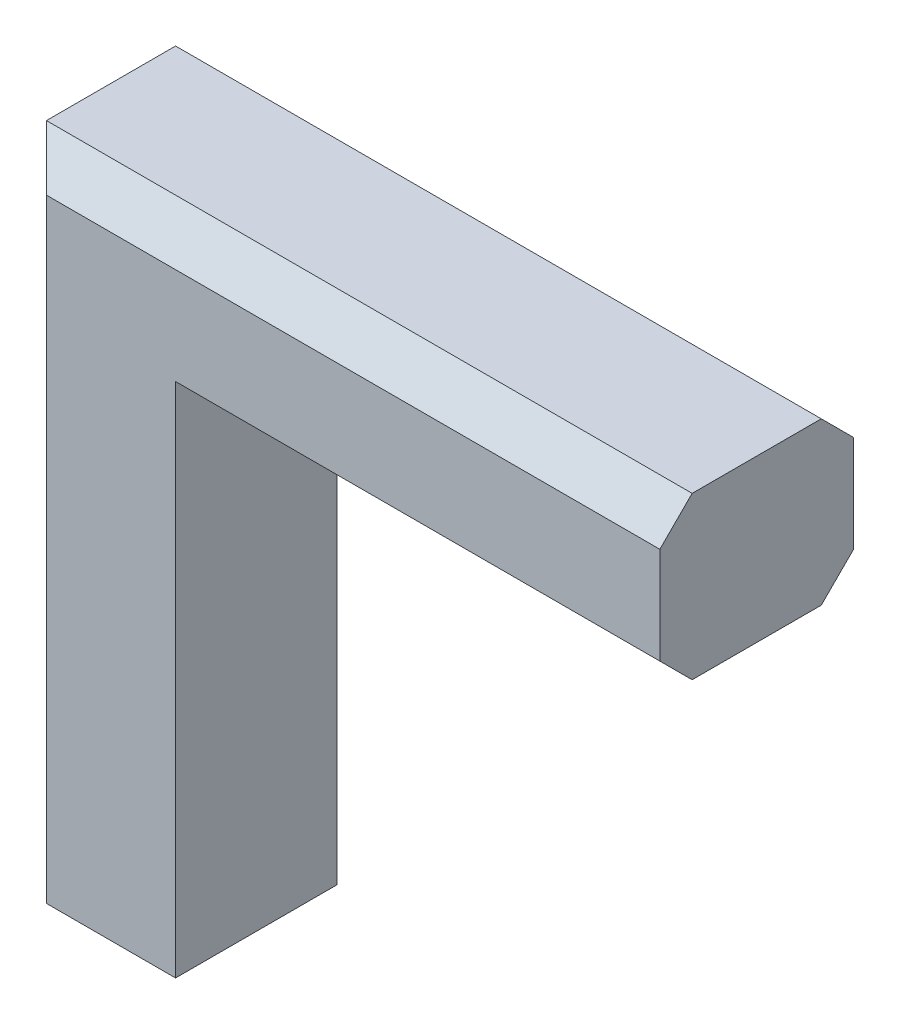
ISO-10303-21;
HEADER;
FILE_DESCRIPTION(('STEP AP214'),'2;1');
FILE_NAME('part.step','',(''),(''),'','','');
FILE_SCHEMA(('AUTOMOTIVE_DESIGN { 1 0 10303 214 1 1 1 1 }'));
ENDSEC;
DATA;
#1=APPLICATION_CONTEXT('core data for automotive mechanical design processes');
#2=APPLICATION_PROTOCOL_DEFINITION('international standard','automotive_design',2000,#1);
#3=PRODUCT_CONTEXT('',#1,'mechanical');
#4=PRODUCT('Part','Part','',(#3));
#5=PRODUCT_RELATED_PRODUCT_CATEGORY('part','',(#4));
#6=PRODUCT_DEFINITION_FORMATION('','',#4);
#7=PRODUCT_DEFINITION_CONTEXT('part definition',#1,'design');
#8=PRODUCT_DEFINITION('design','',#6,#7);
#9=PRODUCT_DEFINITION_SHAPE('','',#8);
#10=(LENGTH_UNIT() NAMED_UNIT(*) SI_UNIT(.MILLI.,.METRE.));
#11=(NAMED_UNIT(*) PLANE_ANGLE_UNIT() SI_UNIT($,.RADIAN.));
#12=(NAMED_UNIT(*) SI_UNIT($,.STERADIAN.) SOLID_ANGLE_UNIT());
#13=UNCERTAINTY_MEASURE_WITH_UNIT(LENGTH_MEASURE(1.E-05),#10,'distance_accuracy_value','');
#14=(GEOMETRIC_REPRESENTATION_CONTEXT(3) GLOBAL_UNCERTAINTY_ASSIGNED_CONTEXT((#13)) GLOBAL_UNIT_ASSIGNED_CONTEXT((#10,
#11,#12)) REPRESENTATION_CONTEXT('',''));
#15=CARTESIAN_POINT('',(0.,0.,0.));
#16=DIRECTION('',(0.,0.,1.));
#17=DIRECTION('',(1.,0.,0.));
#18=AXIS2_PLACEMENT_3D('',#15,#16,#17);
#19=CARTESIAN_POINT('',(0.5,-3.75,0.5));
#20=DIRECTION('',(-0.707106781186547,0.,-0.707106781186548));
#21=DIRECTION('',(-0.707106781186548,0.,0.707106781186547));
#22=AXIS2_PLACEMENT_3D('',#19,#20,#21);
#23=PLANE('',#22);
#24=DIRECTION('',(0.,1.,0.));
#25=VECTOR('',#24,1.);
#26=CARTESIAN_POINT('',(0.,0.,1.));
#27=LINE('',#26,#25);
#28=CARTESIAN_POINT('',(0.,5.,1.));
#29=VERTEX_POINT('',#28);
#30=CARTESIAN_POINT('',(0.,-15.,1.));
#31=VERTEX_POINT('',#30);
#32=EDGE_CURVE('E111',#29,#31,#27,.F.);
#33=ORIENTED_EDGE('',*,*,#32,.F.);
#34=DIRECTION('',(-0.577350269189626,0.577350269189626,0.577350269189625));
#35=VECTOR('',#34,1.);
#36=CARTESIAN_POINT('',(1.,4.,0.));
#37=LINE('',#36,#35);
#38=CARTESIAN_POINT('',(0.999999999999999,4.,0.));
#39=VERTEX_POINT('',#38);
#40=EDGE_CURVE('E105',#39,#29,#37,.T.);
#41=ORIENTED_EDGE('',*,*,#40,.F.);
#42=DIRECTION('',(0.,1.,0.));
#43=VECTOR('',#42,1.);
#44=CARTESIAN_POINT('',(1.,-7.5,0.));
#45=LINE('',#44,#43);
#46=CARTESIAN_POINT('',(1.,-15.,0.));
#47=VERTEX_POINT('',#46);
#48=EDGE_CURVE('E108',#39,#47,#45,.F.);
#49=ORIENTED_EDGE('',*,*,#48,.T.);
#50=DIRECTION('',(-0.707106781186548,0.,0.707106781186547));
#51=VECTOR('',#50,1.);
#52=CARTESIAN_POINT('',(0.5,-15.,0.5));
#53=LINE('',#52,#51);
#54=EDGE_CURVE('E19',#47,#31,#53,.T.);
#55=ORIENTED_EDGE('',*,*,#54,.T.);
#56=EDGE_LOOP('',(#33,#41,#49,#55));
#57=FACE_BOUND('',#56,.T.);
#58=ADVANCED_FACE('F16',(#57),#23,.T.);
#59=CARTESIAN_POINT('',(11.25,4.5,0.5));
#60=DIRECTION('',(0.,0.707106781186547,-0.707106781186548));
#61=DIRECTION('',(0.,0.707106781186548,0.707106781186547));
#62=AXIS2_PLACEMENT_3D('',#59,#60,#61);
#63=PLANE('',#62);
#64=DIRECTION('',(1.,0.,0.));
#65=VECTOR('',#64,1.);
#66=CARTESIAN_POINT('',(2.5,4.,0.));
#67=LINE('',#66,#65);
#68=CARTESIAN_POINT('',(20.,4.,0.));
#69=VERTEX_POINT('',#68);
#70=EDGE_CURVE('E119',#69,#39,#67,.F.);
#71=ORIENTED_EDGE('',*,*,#70,.T.);
#72=ORIENTED_EDGE('',*,*,#40,.T.);
#73=DIRECTION('',(1.,0.,0.));
#74=VECTOR('',#73,1.);
#75=CARTESIAN_POINT('',(20.,5.,1.));
#76=LINE('',#75,#74);
#77=CARTESIAN_POINT('',(20.,5.,1.));
#78=VERTEX_POINT('',#77);
#79=EDGE_CURVE('E171',#78,#29,#76,.F.);
#80=ORIENTED_EDGE('',*,*,#79,.F.);
#81=DIRECTION('',(0.,0.707106781186548,0.707106781186547));
#82=VECTOR('',#81,1.);
#83=CARTESIAN_POINT('',(20.,4.5,0.5));
#84=LINE('',#83,#82);
#85=EDGE_CURVE('E116',#78,#69,#84,.F.);
#86=ORIENTED_EDGE('',*,*,#85,.T.);
#87=EDGE_LOOP('',(#71,#72,#80,#86));
#88=FACE_BOUND('',#87,.T.);
#89=ADVANCED_FACE('F120',(#88),#63,.T.);
#90=CARTESIAN_POINT('',(1.25,0.5,0.5));
#91=DIRECTION('',(0.,-0.707106781186548,-0.707106781186547));
#92=DIRECTION('',(0.,0.707106781186547,-0.707106781186548));
#93=AXIS2_PLACEMENT_3D('',#90,#91,#92);
#94=PLANE('',#93);
#95=DIRECTION('',(1.,0.,0.));
#96=VECTOR('',#95,1.);
#97=CARTESIAN_POINT('',(0.,0.,1.));
#98=LINE('',#97,#96);
#99=CARTESIAN_POINT('',(5.,0.,1.));
#100=VERTEX_POINT('',#99);
#101=CARTESIAN_POINT('',(20.,0.,1.));
#102=VERTEX_POINT('',#101);
#103=EDGE_CURVE('E167',#100,#102,#98,.T.);
#104=ORIENTED_EDGE('',*,*,#103,.F.);
#105=DIRECTION('',(0.577350269189625,-0.577350269189626,0.577350269189626));
#106=VECTOR('',#105,1.);
#107=CARTESIAN_POINT('',(4.,1.,0.));
#108=LINE('',#107,#106);
#109=CARTESIAN_POINT('',(4.,1.,0.));
#110=VERTEX_POINT('',#109);
#111=EDGE_CURVE('E99',#110,#100,#108,.T.);
#112=ORIENTED_EDGE('',*,*,#111,.F.);
#113=DIRECTION('',(1.,0.,0.));
#114=VECTOR('',#113,1.);
#115=CARTESIAN_POINT('',(2.5,1.,0.));
#116=LINE('',#115,#114);
#117=CARTESIAN_POINT('',(20.,1.,0.));
#118=VERTEX_POINT('',#117);
#119=EDGE_CURVE('E131',#110,#118,#116,.T.);
#120=ORIENTED_EDGE('',*,*,#119,.T.);
#121=DIRECTION('',(0.,0.707106781186547,-0.707106781186548));
#122=VECTOR('',#121,1.);
#123=CARTESIAN_POINT('',(20.,0.5,0.5));
#124=LINE('',#123,#122);
#125=EDGE_CURVE('E115',#118,#102,#124,.F.);
#126=ORIENTED_EDGE('',*,*,#125,.T.);
#127=EDGE_LOOP('',(#104,#112,#120,#126));
#128=FACE_BOUND('',#127,.T.);
#129=ADVANCED_FACE('F173',(#128),#94,.T.);
#130=CARTESIAN_POINT('',(0.,0.,0.));
#131=DIRECTION('',(-1.,0.,0.));
#132=DIRECTION('',(0.,0.,1.));
#133=AXIS2_PLACEMENT_3D('',#130,#131,#132);
#134=PLANE('',#133);
#135=DIRECTION('',(0.,1.,0.));
#136=VECTOR('',#135,1.);
#137=CARTESIAN_POINT('',(0.,-3.75,5.));
#138=LINE('',#137,#136);
#139=CARTESIAN_POINT('',(0.,5.,5.));
#140=VERTEX_POINT('',#139);
#141=CARTESIAN_POINT('',(0.,-15.,5.));
#142=VERTEX_POINT('',#141);
#143=EDGE_CURVE('E159',#140,#142,#138,.F.);
#144=ORIENTED_EDGE('',*,*,#143,.F.);
#145=DIRECTION('',(0.,0.,1.));
#146=VECTOR('',#145,1.);
#147=CARTESIAN_POINT('',(0.,5.,0.));
#148=LINE('',#147,#146);
#149=EDGE_CURVE('E145',#29,#140,#148,.T.);
#150=ORIENTED_EDGE('',*,*,#149,.F.);
#151=ORIENTED_EDGE('',*,*,#32,.T.);
#152=DIRECTION('',(0.,0.,-1.));
#153=VECTOR('',#152,1.);
#154=CARTESIAN_POINT('',(0.,-15.,0.));
#155=LINE('',#154,#153);
#156=EDGE_CURVE('E143',#142,#31,#155,.T.);
#157=ORIENTED_EDGE('',*,*,#156,.F.);
#158=EDGE_LOOP('',(#144,#150,#151,#157));
#159=FACE_BOUND('',#158,.T.);
#160=ADVANCED_FACE('F142',(#159),#134,.T.);
#161=CARTESIAN_POINT('',(4.5,-11.25,0.5));
#162=DIRECTION('',(0.707106781186548,0.,-0.707106781186547));
#163=DIRECTION('',(-0.707106781186547,0.,-0.707106781186548));
#164=AXIS2_PLACEMENT_3D('',#161,#162,#163);
#165=PLANE('',#164);
#166=DIRECTION('',(0.,1.,0.));
#167=VECTOR('',#166,1.);
#168=CARTESIAN_POINT('',(4.,-7.5,0.));
#169=LINE('',#168,#167);
#170=CARTESIAN_POINT('',(4.,-15.,0.));
#171=VERTEX_POINT('',#170);
#172=EDGE_CURVE('E129',#171,#110,#169,.T.);
#173=ORIENTED_EDGE('',*,*,#172,.T.);
#174=ORIENTED_EDGE('',*,*,#111,.T.);
#175=DIRECTION('',(0.,1.,0.));
#176=VECTOR('',#175,1.);
#177=CARTESIAN_POINT('',(5.,-15.,1.));
#178=LINE('',#177,#176);
#179=CARTESIAN_POINT('',(5.,-15.,1.));
#180=VERTEX_POINT('',#179);
#181=EDGE_CURVE('E151',#180,#100,#178,.T.);
#182=ORIENTED_EDGE('',*,*,#181,.F.);
#183=DIRECTION('',(0.707106781186548,0.,0.707106781186548));
#184=VECTOR('',#183,1.);
#185=CARTESIAN_POINT('',(4.,-15.,0.));
#186=LINE('',#185,#184);
#187=EDGE_CURVE('E153',#171,#180,#186,.T.);
#188=ORIENTED_EDGE('',*,*,#187,.F.);
#189=EDGE_LOOP('',(#173,#174,#182,#188));
#190=FACE_BOUND('',#189,.T.);
#191=ADVANCED_FACE('F199',(#190),#165,.T.);
#192=CARTESIAN_POINT('',(2.5,-7.5,0.));
#193=DIRECTION('',(0.,0.,1.));
#194=DIRECTION('',(1.,0.,0.));
#195=AXIS2_PLACEMENT_3D('',#192,#193,#194);
#196=PLANE('',#195);
#197=ORIENTED_EDGE('',*,*,#172,.F.);
#198=DIRECTION('',(1.,0.,0.));
#199=VECTOR('',#198,1.);
#200=CARTESIAN_POINT('',(0.,-15.,0.));
#201=LINE('',#200,#199);
#202=EDGE_CURVE('E128',#47,#171,#201,.T.);
#203=ORIENTED_EDGE('',*,*,#202,.F.);
#204=ORIENTED_EDGE('',*,*,#48,.F.);
#205=ORIENTED_EDGE('',*,*,#70,.F.);
#206=DIRECTION('',(0.,1.,0.));
#207=VECTOR('',#206,1.);
#208=CARTESIAN_POINT('',(20.,0.,0.));
#209=LINE('',#208,#207);
#210=EDGE_CURVE('E174',#118,#69,#209,.T.);
#211=ORIENTED_EDGE('',*,*,#210,.F.);
#212=ORIENTED_EDGE('',*,*,#119,.F.);
#213=EDGE_LOOP('',(#197,#203,#204,#205,#211,#212));
#214=FACE_BOUND('',#213,.T.);
#215=ADVANCED_FACE('F126',(#214),#196,.F.);
#216=CARTESIAN_POINT('',(20.,5.,0.));
#217=DIRECTION('',(0.,1.,0.));
#218=DIRECTION('',(0.,0.,1.));
#219=AXIS2_PLACEMENT_3D('',#216,#217,#218);
#220=PLANE('',#219);
#221=ORIENTED_EDGE('',*,*,#79,.T.);
#222=ORIENTED_EDGE('',*,*,#149,.T.);
#223=DIRECTION('',(1.,0.,0.));
#224=VECTOR('',#223,1.);
#225=CARTESIAN_POINT('',(11.25,5.,5.));
#226=LINE('',#225,#224);
#227=CARTESIAN_POINT('',(20.,5.,5.));
#228=VERTEX_POINT('',#227);
#229=EDGE_CURVE('E164',#228,#140,#226,.F.);
#230=ORIENTED_EDGE('',*,*,#229,.F.);
#231=DIRECTION('',(0.,0.,-1.));
#232=VECTOR('',#231,1.);
#233=CARTESIAN_POINT('',(20.,5.,0.));
#234=LINE('',#233,#232);
#235=EDGE_CURVE('E176',#78,#228,#234,.F.);
#236=ORIENTED_EDGE('',*,*,#235,.F.);
#237=EDGE_LOOP('',(#221,#222,#230,#236));
#238=FACE_BOUND('',#237,.T.);
#239=ADVANCED_FACE('F232',(#238),#220,.T.);
#240=CARTESIAN_POINT('',(0.,0.,0.));
#241=DIRECTION('',(0.,-1.,0.));
#242=DIRECTION('',(0.,0.,-1.));
#243=AXIS2_PLACEMENT_3D('',#240,#241,#242);
#244=PLANE('',#243);
#245=DIRECTION('',(1.,0.,0.));
#246=VECTOR('',#245,1.);
#247=CARTESIAN_POINT('',(1.25,0.,5.));
#248=LINE('',#247,#246);
#249=CARTESIAN_POINT('',(5.,0.,5.));
#250=VERTEX_POINT('',#249);
#251=CARTESIAN_POINT('',(20.,0.,5.));
#252=VERTEX_POINT('',#251);
#253=EDGE_CURVE('E177',#250,#252,#248,.T.);
#254=ORIENTED_EDGE('',*,*,#253,.F.);
#255=DIRECTION('',(0.,0.,-1.));
#256=VECTOR('',#255,1.);
#257=CARTESIAN_POINT('',(5.,0.,0.));
#258=LINE('',#257,#256);
#259=EDGE_CURVE('E191',#100,#250,#258,.F.);
#260=ORIENTED_EDGE('',*,*,#259,.F.);
#261=ORIENTED_EDGE('',*,*,#103,.T.);
#262=DIRECTION('',(0.,0.,-1.));
#263=VECTOR('',#262,1.);
#264=CARTESIAN_POINT('',(20.,0.,0.));
#265=LINE('',#264,#263);
#266=EDGE_CURVE('E218',#252,#102,#265,.T.);
#267=ORIENTED_EDGE('',*,*,#266,.F.);
#268=EDGE_LOOP('',(#254,#260,#261,#267));
#269=FACE_BOUND('',#268,.T.);
#270=ADVANCED_FACE('F229',(#269),#244,.T.);
#271=CARTESIAN_POINT('',(11.25,4.5,5.5));
#272=DIRECTION('',(0.,0.707106781186547,0.707106781186548));
#273=DIRECTION('',(0.,-0.707106781186548,0.707106781186547));
#274=AXIS2_PLACEMENT_3D('',#271,#272,#273);
#275=PLANE('',#274);
#276=DIRECTION('',(0.,-0.707106781186548,0.707106781186548));
#277=VECTOR('',#276,1.);
#278=CARTESIAN_POINT('',(20.,5.,5.));
#279=LINE('',#278,#277);
#280=CARTESIAN_POINT('',(20.,4.,6.));
#281=VERTEX_POINT('',#280);
#282=EDGE_CURVE('E180',#228,#281,#279,.T.);
#283=ORIENTED_EDGE('',*,*,#282,.F.);
#284=ORIENTED_EDGE('',*,*,#229,.T.);
#285=DIRECTION('',(-0.577350269189626,0.577350269189626,-0.577350269189625));
#286=VECTOR('',#285,1.);
#287=CARTESIAN_POINT('',(1.,4.,6.));
#288=LINE('',#287,#286);
#289=CARTESIAN_POINT('',(1.,4.,6.));
#290=VERTEX_POINT('',#289);
#291=EDGE_CURVE('E161',#290,#140,#288,.T.);
#292=ORIENTED_EDGE('',*,*,#291,.F.);
#293=DIRECTION('',(1.,0.,0.));
#294=VECTOR('',#293,1.);
#295=CARTESIAN_POINT('',(2.5,4.,6.));
#296=LINE('',#295,#294);
#297=EDGE_CURVE('E213',#281,#290,#296,.F.);
#298=ORIENTED_EDGE('',*,*,#297,.F.);
#299=EDGE_LOOP('',(#283,#284,#292,#298));
#300=FACE_BOUND('',#299,.T.);
#301=ADVANCED_FACE('F231',(#300),#275,.T.);
#302=CARTESIAN_POINT('',(0.5,-3.75,5.5));
#303=DIRECTION('',(-0.707106781186547,0.,0.707106781186548));
#304=DIRECTION('',(0.707106781186548,0.,0.707106781186547));
#305=AXIS2_PLACEMENT_3D('',#302,#303,#304);
#306=PLANE('',#305);
#307=DIRECTION('',(-0.707106781186548,0.,-0.707106781186548));
#308=VECTOR('',#307,1.);
#309=CARTESIAN_POINT('',(1.,-15.,6.));
#310=LINE('',#309,#308);
#311=CARTESIAN_POINT('',(1.,-15.,6.));
#312=VERTEX_POINT('',#311);
#313=EDGE_CURVE('E149',#312,#142,#310,.T.);
#314=ORIENTED_EDGE('',*,*,#313,.F.);
#315=DIRECTION('',(0.,1.,0.));
#316=VECTOR('',#315,1.);
#317=CARTESIAN_POINT('',(1.,-7.5,6.));
#318=LINE('',#317,#316);
#319=EDGE_CURVE('E211',#290,#312,#318,.F.);
#320=ORIENTED_EDGE('',*,*,#319,.F.);
#321=ORIENTED_EDGE('',*,*,#291,.T.);
#322=ORIENTED_EDGE('',*,*,#143,.T.);
#323=EDGE_LOOP('',(#314,#320,#321,#322));
#324=FACE_BOUND('',#323,.T.);
#325=ADVANCED_FACE('F239',(#324),#306,.T.);
#326=CARTESIAN_POINT('',(0.,-15.,0.));
#327=DIRECTION('',(0.,-1.,0.));
#328=DIRECTION('',(0.,0.,-1.));
#329=AXIS2_PLACEMENT_3D('',#326,#327,#328);
#330=PLANE('',#329);
#331=ORIENTED_EDGE('',*,*,#54,.F.);
#332=ORIENTED_EDGE('',*,*,#202,.T.);
#333=ORIENTED_EDGE('',*,*,#187,.T.);
#334=DIRECTION('',(0.,0.,-1.));
#335=VECTOR('',#334,1.);
#336=CARTESIAN_POINT('',(5.,-15.,0.));
#337=LINE('',#336,#335);
#338=CARTESIAN_POINT('',(5.,-15.,6.));
#339=VERTEX_POINT('',#338);
#340=EDGE_CURVE('E188',#339,#180,#337,.T.);
#341=ORIENTED_EDGE('',*,*,#340,.F.);
#342=DIRECTION('',(1.,0.,0.));
#343=VECTOR('',#342,1.);
#344=CARTESIAN_POINT('',(2.5,-15.,6.));
#345=LINE('',#344,#343);
#346=EDGE_CURVE('E201',#312,#339,#345,.T.);
#347=ORIENTED_EDGE('',*,*,#346,.F.);
#348=ORIENTED_EDGE('',*,*,#313,.T.);
#349=ORIENTED_EDGE('',*,*,#156,.T.);
#350=EDGE_LOOP('',(#331,#332,#333,#341,#347,#348,#349));
#351=FACE_BOUND('',#350,.T.);
#352=ADVANCED_FACE('F147',(#351),#330,.T.);
#353=CARTESIAN_POINT('',(5.,-15.,0.));
#354=DIRECTION('',(1.,0.,0.));
#355=DIRECTION('',(0.,0.,-1.));
#356=AXIS2_PLACEMENT_3D('',#353,#354,#355);
#357=PLANE('',#356);
#358=DIRECTION('',(0.,1.,0.));
#359=VECTOR('',#358,1.);
#360=CARTESIAN_POINT('',(5.,-7.5,6.));
#361=LINE('',#360,#359);
#362=CARTESIAN_POINT('',(5.,1.,6.));
#363=VERTEX_POINT('',#362);
#364=EDGE_CURVE('E204',#339,#363,#361,.T.);
#365=ORIENTED_EDGE('',*,*,#364,.F.);
#366=ORIENTED_EDGE('',*,*,#340,.T.);
#367=ORIENTED_EDGE('',*,*,#181,.T.);
#368=ORIENTED_EDGE('',*,*,#259,.T.);
#369=DIRECTION('',(0.,-0.707106781186548,-0.707106781186547));
#370=VECTOR('',#369,1.);
#371=CARTESIAN_POINT('',(5.,0.5,5.5));
#372=LINE('',#371,#370);
#373=EDGE_CURVE('E182',#363,#250,#372,.T.);
#374=ORIENTED_EDGE('',*,*,#373,.F.);
#375=EDGE_LOOP('',(#365,#366,#367,#368,#374));
#376=FACE_BOUND('',#375,.T.);
#377=ADVANCED_FACE('F195',(#376),#357,.T.);
#378=CARTESIAN_POINT('',(1.25,0.5,5.5));
#379=DIRECTION('',(0.,-0.707106781186547,0.707106781186548));
#380=DIRECTION('',(0.,-0.707106781186548,-0.707106781186547));
#381=AXIS2_PLACEMENT_3D('',#378,#379,#380);
#382=PLANE('',#381);
#383=ORIENTED_EDGE('',*,*,#373,.T.);
#384=ORIENTED_EDGE('',*,*,#253,.T.);
#385=DIRECTION('',(0.,-0.707106781186548,-0.707106781186548));
#386=VECTOR('',#385,1.);
#387=CARTESIAN_POINT('',(20.,1.,6.));
#388=LINE('',#387,#386);
#389=CARTESIAN_POINT('',(20.,1.,6.));
#390=VERTEX_POINT('',#389);
#391=EDGE_CURVE('E34',#390,#252,#388,.T.);
#392=ORIENTED_EDGE('',*,*,#391,.F.);
#393=DIRECTION('',(1.,0.,0.));
#394=VECTOR('',#393,1.);
#395=CARTESIAN_POINT('',(2.5,1.,6.));
#396=LINE('',#395,#394);
#397=EDGE_CURVE('E25',#363,#390,#396,.T.);
#398=ORIENTED_EDGE('',*,*,#397,.F.);
#399=EDGE_LOOP('',(#383,#384,#392,#398));
#400=FACE_BOUND('',#399,.T.);
#401=ADVANCED_FACE('F226',(#400),#382,.T.);
#402=CARTESIAN_POINT('',(20.,0.,0.));
#403=DIRECTION('',(1.,0.,0.));
#404=DIRECTION('',(0.,0.,-1.));
#405=AXIS2_PLACEMENT_3D('',#402,#403,#404);
#406=PLANE('',#405);
#407=ORIENTED_EDGE('',*,*,#391,.T.);
#408=ORIENTED_EDGE('',*,*,#266,.T.);
#409=ORIENTED_EDGE('',*,*,#125,.F.);
#410=ORIENTED_EDGE('',*,*,#210,.T.);
#411=ORIENTED_EDGE('',*,*,#85,.F.);
#412=ORIENTED_EDGE('',*,*,#235,.T.);
#413=ORIENTED_EDGE('',*,*,#282,.T.);
#414=DIRECTION('',(0.,1.,0.));
#415=VECTOR('',#414,1.);
#416=CARTESIAN_POINT('',(20.,-7.5,6.));
#417=LINE('',#416,#415);
#418=EDGE_CURVE('E11',#390,#281,#417,.T.);
#419=ORIENTED_EDGE('',*,*,#418,.F.);
#420=EDGE_LOOP('',(#407,#408,#409,#410,#411,#412,#413,#419));
#421=FACE_BOUND('',#420,.T.);
#422=ADVANCED_FACE('F223',(#421),#406,.T.);
#423=CARTESIAN_POINT('',(2.5,-7.5,6.));
#424=DIRECTION('',(0.,0.,1.));
#425=DIRECTION('',(1.,0.,0.));
#426=AXIS2_PLACEMENT_3D('',#423,#424,#425);
#427=PLANE('',#426);
#428=ORIENTED_EDGE('',*,*,#397,.T.);
#429=ORIENTED_EDGE('',*,*,#418,.T.);
#430=ORIENTED_EDGE('',*,*,#297,.T.);
#431=ORIENTED_EDGE('',*,*,#319,.T.);
#432=ORIENTED_EDGE('',*,*,#346,.T.);
#433=ORIENTED_EDGE('',*,*,#364,.T.);
#434=EDGE_LOOP('',(#428,#429,#430,#431,#432,#433));
#435=FACE_BOUND('',#434,.T.);
#436=ADVANCED_FACE('F208',(#435),#427,.T.);
#437=CLOSED_SHELL('',(#58,#89,#129,#160,#191,#215,#239,#270,#301,#325,#352,#377,#401,#422,#436));
#438=MANIFOLD_SOLID_BREP('B1',#437);
#439=ADVANCED_BREP_SHAPE_REPRESENTATION('',(#18,#438),#14);
#440=SHAPE_DEFINITION_REPRESENTATION(#9,#439);
ENDSEC;
END-ISO-10303-21;
